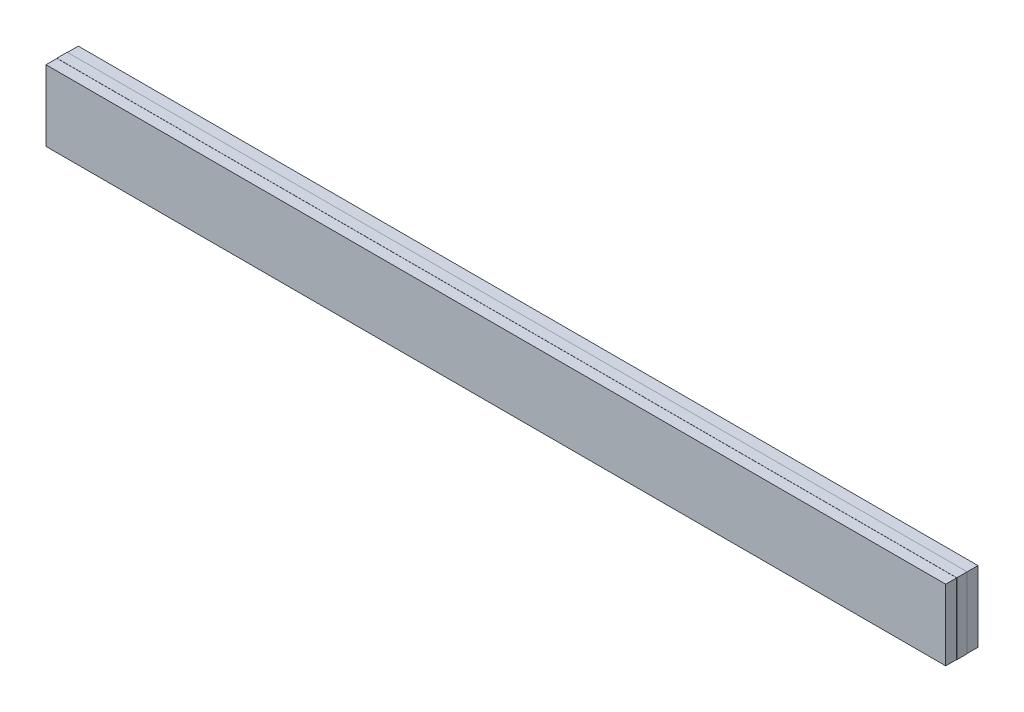
ISO-10303-21;
HEADER;
FILE_DESCRIPTION(('STEP AP214'),'2;1');
FILE_NAME('part.step','',(''),(''),'','','');
FILE_SCHEMA(('AUTOMOTIVE_DESIGN { 1 0 10303 214 1 1 1 1 }'));
ENDSEC;
DATA;
#1=APPLICATION_CONTEXT('core data for automotive mechanical design processes');
#2=APPLICATION_PROTOCOL_DEFINITION('international standard','automotive_design',2000,#1);
#3=PRODUCT_CONTEXT('',#1,'mechanical');
#4=PRODUCT('Part','Part','',(#3));
#5=PRODUCT_RELATED_PRODUCT_CATEGORY('part','',(#4));
#6=PRODUCT_DEFINITION_FORMATION('','',#4);
#7=PRODUCT_DEFINITION_CONTEXT('part definition',#1,'design');
#8=PRODUCT_DEFINITION('design','',#6,#7);
#9=PRODUCT_DEFINITION_SHAPE('','',#8);
#10=(LENGTH_UNIT() NAMED_UNIT(*) SI_UNIT(.MILLI.,.METRE.));
#11=(NAMED_UNIT(*) PLANE_ANGLE_UNIT() SI_UNIT($,.RADIAN.));
#12=(NAMED_UNIT(*) SI_UNIT($,.STERADIAN.) SOLID_ANGLE_UNIT());
#13=UNCERTAINTY_MEASURE_WITH_UNIT(LENGTH_MEASURE(1.E-05),#10,'distance_accuracy_value','');
#14=(GEOMETRIC_REPRESENTATION_CONTEXT(3) GLOBAL_UNCERTAINTY_ASSIGNED_CONTEXT((#13)) GLOBAL_UNIT_ASSIGNED_CONTEXT((#10,
#11,#12)) REPRESENTATION_CONTEXT('',''));
#15=CARTESIAN_POINT('',(0.,0.,0.));
#16=DIRECTION('',(0.,0.,1.));
#17=DIRECTION('',(1.,0.,0.));
#18=AXIS2_PLACEMENT_3D('',#15,#16,#17);
#19=CARTESIAN_POINT('',(0.,0.,-0.4));
#20=DIRECTION('',(0.,0.,1.));
#21=DIRECTION('',(1.,0.,0.));
#22=AXIS2_PLACEMENT_3D('',#19,#20,#21);
#23=PLANE('',#22);
#24=DIRECTION('',(0.,1.,0.));
#25=VECTOR('',#24,1.);
#26=CARTESIAN_POINT('',(34.85,2.75,-0.4));
#27=LINE('',#26,#25);
#28=CARTESIAN_POINT('',(34.85,-2.75,-0.4));
#29=VERTEX_POINT('',#28);
#30=CARTESIAN_POINT('',(34.85,2.75,-0.4));
#31=VERTEX_POINT('',#30);
#32=EDGE_CURVE('E185',#29,#31,#27,.T.);
#33=ORIENTED_EDGE('',*,*,#32,.F.);
#34=DIRECTION('',(1.,0.,0.));
#35=VECTOR('',#34,1.);
#36=CARTESIAN_POINT('',(-34.85,-2.75,-0.4));
#37=LINE('',#36,#35);
#38=CARTESIAN_POINT('',(-34.85,-2.75,-0.4));
#39=VERTEX_POINT('',#38);
#40=EDGE_CURVE('E190',#39,#29,#37,.T.);
#41=ORIENTED_EDGE('',*,*,#40,.F.);
#42=DIRECTION('',(0.,-1.,0.));
#43=VECTOR('',#42,1.);
#44=CARTESIAN_POINT('',(-34.85,2.75,-0.4));
#45=LINE('',#44,#43);
#46=CARTESIAN_POINT('',(-34.85,2.75,-0.4));
#47=VERTEX_POINT('',#46);
#48=EDGE_CURVE('E204',#47,#39,#45,.T.);
#49=ORIENTED_EDGE('',*,*,#48,.F.);
#50=DIRECTION('',(-1.,0.,0.));
#51=VECTOR('',#50,1.);
#52=CARTESIAN_POINT('',(-34.85,2.75,-0.4));
#53=LINE('',#52,#51);
#54=EDGE_CURVE('E201',#31,#47,#53,.T.);
#55=ORIENTED_EDGE('',*,*,#54,.F.);
#56=EDGE_LOOP('',(#33,#41,#49,#55));
#57=FACE_BOUND('',#56,.T.);
#58=DIRECTION('',(1.,0.,0.));
#59=VECTOR('',#58,1.);
#60=CARTESIAN_POINT('',(-34.84,2.74,-0.4));
#61=LINE('',#60,#59);
#62=CARTESIAN_POINT('',(-34.84,2.74,-0.4));
#63=VERTEX_POINT('',#62);
#64=CARTESIAN_POINT('',(34.84,2.74,-0.4));
#65=VERTEX_POINT('',#64);
#66=EDGE_CURVE('E146',#63,#65,#61,.T.);
#67=ORIENTED_EDGE('',*,*,#66,.F.);
#68=DIRECTION('',(0.,1.,0.));
#69=VECTOR('',#68,1.);
#70=CARTESIAN_POINT('',(-34.84,-2.74,-0.4));
#71=LINE('',#70,#69);
#72=CARTESIAN_POINT('',(-34.84,-2.74,-0.4));
#73=VERTEX_POINT('',#72);
#74=EDGE_CURVE('E143',#73,#63,#71,.T.);
#75=ORIENTED_EDGE('',*,*,#74,.F.);
#76=DIRECTION('',(-1.,0.,0.));
#77=VECTOR('',#76,1.);
#78=CARTESIAN_POINT('',(34.84,-2.74,-0.4));
#79=LINE('',#78,#77);
#80=CARTESIAN_POINT('',(34.84,-2.74,-0.4));
#81=VERTEX_POINT('',#80);
#82=EDGE_CURVE('E56',#81,#73,#79,.T.);
#83=ORIENTED_EDGE('',*,*,#82,.F.);
#84=DIRECTION('',(0.,-1.,0.));
#85=VECTOR('',#84,1.);
#86=CARTESIAN_POINT('',(34.84,2.74,-0.4));
#87=LINE('',#86,#85);
#88=EDGE_CURVE('E51',#65,#81,#87,.T.);
#89=ORIENTED_EDGE('',*,*,#88,.F.);
#90=EDGE_LOOP('',(#67,#75,#83,#89));
#91=FACE_BOUND('',#90,.T.);
#92=ADVANCED_FACE('F36',(#57,#91),#23,.F.);
#93=CARTESIAN_POINT('',(0.,0.,0.4));
#94=DIRECTION('',(0.,0.,1.));
#95=DIRECTION('',(1.,0.,0.));
#96=AXIS2_PLACEMENT_3D('',#93,#94,#95);
#97=PLANE('',#96);
#98=DIRECTION('',(0.,1.,0.));
#99=VECTOR('',#98,1.);
#100=CARTESIAN_POINT('',(34.85,2.75,0.4));
#101=LINE('',#100,#99);
#102=CARTESIAN_POINT('',(34.85,-2.75,0.4));
#103=VERTEX_POINT('',#102);
#104=CARTESIAN_POINT('',(34.85,2.75,0.4));
#105=VERTEX_POINT('',#104);
#106=EDGE_CURVE('E186',#103,#105,#101,.T.);
#107=ORIENTED_EDGE('',*,*,#106,.T.);
#108=DIRECTION('',(-1.,0.,0.));
#109=VECTOR('',#108,1.);
#110=CARTESIAN_POINT('',(-34.85,2.75,0.4));
#111=LINE('',#110,#109);
#112=CARTESIAN_POINT('',(-34.85,2.75,0.4));
#113=VERTEX_POINT('',#112);
#114=EDGE_CURVE('E189',#105,#113,#111,.T.);
#115=ORIENTED_EDGE('',*,*,#114,.T.);
#116=DIRECTION('',(0.,-1.,0.));
#117=VECTOR('',#116,1.);
#118=CARTESIAN_POINT('',(-34.85,2.75,0.4));
#119=LINE('',#118,#117);
#120=CARTESIAN_POINT('',(-34.85,-2.75,0.4));
#121=VERTEX_POINT('',#120);
#122=EDGE_CURVE('E193',#113,#121,#119,.T.);
#123=ORIENTED_EDGE('',*,*,#122,.T.);
#124=DIRECTION('',(1.,0.,0.));
#125=VECTOR('',#124,1.);
#126=CARTESIAN_POINT('',(-34.85,-2.75,0.4));
#127=LINE('',#126,#125);
#128=EDGE_CURVE('E195',#121,#103,#127,.T.);
#129=ORIENTED_EDGE('',*,*,#128,.T.);
#130=EDGE_LOOP('',(#107,#115,#123,#129));
#131=FACE_BOUND('',#130,.T.);
#132=DIRECTION('',(0.,1.,0.));
#133=VECTOR('',#132,1.);
#134=CARTESIAN_POINT('',(34.84,-2.74,0.4));
#135=LINE('',#134,#133);
#136=CARTESIAN_POINT('',(34.84,-2.74,0.4));
#137=VERTEX_POINT('',#136);
#138=CARTESIAN_POINT('',(34.84,2.74,0.4));
#139=VERTEX_POINT('',#138);
#140=EDGE_CURVE('E151',#137,#139,#135,.T.);
#141=ORIENTED_EDGE('',*,*,#140,.F.);
#142=DIRECTION('',(1.,0.,0.));
#143=VECTOR('',#142,1.);
#144=CARTESIAN_POINT('',(-34.84,-2.74,0.4));
#145=LINE('',#144,#143);
#146=CARTESIAN_POINT('',(-34.84,-2.74,0.4));
#147=VERTEX_POINT('',#146);
#148=EDGE_CURVE('E147',#147,#137,#145,.T.);
#149=ORIENTED_EDGE('',*,*,#148,.F.);
#150=DIRECTION('',(0.,-1.,0.));
#151=VECTOR('',#150,1.);
#152=CARTESIAN_POINT('',(-34.84,2.74,0.4));
#153=LINE('',#152,#151);
#154=CARTESIAN_POINT('',(-34.84,2.74,0.4));
#155=VERTEX_POINT('',#154);
#156=EDGE_CURVE('E162',#155,#147,#153,.T.);
#157=ORIENTED_EDGE('',*,*,#156,.F.);
#158=DIRECTION('',(-1.,0.,0.));
#159=VECTOR('',#158,1.);
#160=CARTESIAN_POINT('',(34.84,2.74,0.4));
#161=LINE('',#160,#159);
#162=EDGE_CURVE('E171',#139,#155,#161,.T.);
#163=ORIENTED_EDGE('',*,*,#162,.F.);
#164=EDGE_LOOP('',(#141,#149,#157,#163));
#165=FACE_BOUND('',#164,.T.);
#166=ADVANCED_FACE('F231',(#131,#165),#97,.T.);
#167=CARTESIAN_POINT('',(34.85,2.75,0.4));
#168=DIRECTION('',(-1.,0.,0.));
#169=DIRECTION('',(0.,0.,1.));
#170=AXIS2_PLACEMENT_3D('',#167,#168,#169);
#171=PLANE('',#170);
#172=ORIENTED_EDGE('',*,*,#32,.T.);
#173=DIRECTION('',(0.,0.,-1.));
#174=VECTOR('',#173,1.);
#175=CARTESIAN_POINT('',(34.85,2.75,0.4));
#176=LINE('',#175,#174);
#177=EDGE_CURVE('E11',#105,#31,#176,.T.);
#178=ORIENTED_EDGE('',*,*,#177,.F.);
#179=ORIENTED_EDGE('',*,*,#106,.F.);
#180=DIRECTION('',(0.,0.,-1.));
#181=VECTOR('',#180,1.);
#182=CARTESIAN_POINT('',(34.85,-2.75,0.4));
#183=LINE('',#182,#181);
#184=EDGE_CURVE('E198',#103,#29,#183,.T.);
#185=ORIENTED_EDGE('',*,*,#184,.T.);
#186=EDGE_LOOP('',(#172,#178,#179,#185));
#187=FACE_BOUND('',#186,.T.);
#188=ADVANCED_FACE('F38',(#187),#171,.F.);
#189=CARTESIAN_POINT('',(-34.85,2.75,0.4));
#190=DIRECTION('',(0.,-1.,0.));
#191=DIRECTION('',(0.,0.,-1.));
#192=AXIS2_PLACEMENT_3D('',#189,#190,#191);
#193=PLANE('',#192);
#194=ORIENTED_EDGE('',*,*,#54,.T.);
#195=DIRECTION('',(0.,0.,-1.));
#196=VECTOR('',#195,1.);
#197=CARTESIAN_POINT('',(-34.85,2.75,0.4));
#198=LINE('',#197,#196);
#199=EDGE_CURVE('E44',#113,#47,#198,.T.);
#200=ORIENTED_EDGE('',*,*,#199,.F.);
#201=ORIENTED_EDGE('',*,*,#114,.F.);
#202=ORIENTED_EDGE('',*,*,#177,.T.);
#203=EDGE_LOOP('',(#194,#200,#201,#202));
#204=FACE_BOUND('',#203,.T.);
#205=ADVANCED_FACE('F233',(#204),#193,.F.);
#206=CARTESIAN_POINT('',(-34.85,2.75,0.4));
#207=DIRECTION('',(1.,0.,0.));
#208=DIRECTION('',(0.,0.,-1.));
#209=AXIS2_PLACEMENT_3D('',#206,#207,#208);
#210=PLANE('',#209);
#211=ORIENTED_EDGE('',*,*,#48,.T.);
#212=DIRECTION('',(0.,0.,-1.));
#213=VECTOR('',#212,1.);
#214=CARTESIAN_POINT('',(-34.85,-2.75,0.4));
#215=LINE('',#214,#213);
#216=EDGE_CURVE('E210',#121,#39,#215,.T.);
#217=ORIENTED_EDGE('',*,*,#216,.F.);
#218=ORIENTED_EDGE('',*,*,#122,.F.);
#219=ORIENTED_EDGE('',*,*,#199,.T.);
#220=EDGE_LOOP('',(#211,#217,#218,#219));
#221=FACE_BOUND('',#220,.T.);
#222=ADVANCED_FACE('F217',(#221),#210,.F.);
#223=CARTESIAN_POINT('',(-34.85,-2.75,0.4));
#224=DIRECTION('',(0.,1.,0.));
#225=DIRECTION('',(0.,0.,1.));
#226=AXIS2_PLACEMENT_3D('',#223,#224,#225);
#227=PLANE('',#226);
#228=ORIENTED_EDGE('',*,*,#40,.T.);
#229=ORIENTED_EDGE('',*,*,#184,.F.);
#230=ORIENTED_EDGE('',*,*,#128,.F.);
#231=ORIENTED_EDGE('',*,*,#216,.T.);
#232=EDGE_LOOP('',(#228,#229,#230,#231));
#233=FACE_BOUND('',#232,.T.);
#234=ADVANCED_FACE('F225',(#233),#227,.F.);
#235=CARTESIAN_POINT('',(-34.84,-2.74,1.25));
#236=DIRECTION('',(0.,1.,0.));
#237=DIRECTION('',(0.,0.,1.));
#238=AXIS2_PLACEMENT_3D('',#235,#236,#237);
#239=PLANE('',#238);
#240=ORIENTED_EDGE('',*,*,#148,.T.);
#241=DIRECTION('',(0.,0.,-1.));
#242=VECTOR('',#241,1.);
#243=CARTESIAN_POINT('',(34.84,-2.74,1.25));
#244=LINE('',#243,#242);
#245=CARTESIAN_POINT('',(34.84,-2.74,1.25));
#246=VERTEX_POINT('',#245);
#247=EDGE_CURVE('E183',#246,#137,#244,.T.);
#248=ORIENTED_EDGE('',*,*,#247,.F.);
#249=DIRECTION('',(1.,0.,0.));
#250=VECTOR('',#249,1.);
#251=CARTESIAN_POINT('',(-34.84,-2.74,1.25));
#252=LINE('',#251,#250);
#253=CARTESIAN_POINT('',(-34.84,-2.74,1.25));
#254=VERTEX_POINT('',#253);
#255=EDGE_CURVE('E157',#254,#246,#252,.T.);
#256=ORIENTED_EDGE('',*,*,#255,.F.);
#257=DIRECTION('',(0.,0.,-1.));
#258=VECTOR('',#257,1.);
#259=CARTESIAN_POINT('',(-34.84,-2.74,1.25));
#260=LINE('',#259,#258);
#261=EDGE_CURVE('E168',#254,#147,#260,.T.);
#262=ORIENTED_EDGE('',*,*,#261,.T.);
#263=EDGE_LOOP('',(#240,#248,#256,#262));
#264=FACE_BOUND('',#263,.T.);
#265=ADVANCED_FACE('F249',(#264),#239,.F.);
#266=CARTESIAN_POINT('',(34.84,-2.74,1.25));
#267=DIRECTION('',(-1.,0.,0.));
#268=DIRECTION('',(0.,0.,1.));
#269=AXIS2_PLACEMENT_3D('',#266,#267,#268);
#270=PLANE('',#269);
#271=ORIENTED_EDGE('',*,*,#140,.T.);
#272=DIRECTION('',(0.,0.,-1.));
#273=VECTOR('',#272,1.);
#274=CARTESIAN_POINT('',(34.84,2.74,1.25));
#275=LINE('',#274,#273);
#276=CARTESIAN_POINT('',(34.84,2.74,1.25));
#277=VERTEX_POINT('',#276);
#278=EDGE_CURVE('E180',#277,#139,#275,.T.);
#279=ORIENTED_EDGE('',*,*,#278,.F.);
#280=DIRECTION('',(0.,1.,0.));
#281=VECTOR('',#280,1.);
#282=CARTESIAN_POINT('',(34.84,-2.74,1.25));
#283=LINE('',#282,#281);
#284=EDGE_CURVE('E161',#246,#277,#283,.T.);
#285=ORIENTED_EDGE('',*,*,#284,.F.);
#286=ORIENTED_EDGE('',*,*,#247,.T.);
#287=EDGE_LOOP('',(#271,#279,#285,#286));
#288=FACE_BOUND('',#287,.T.);
#289=ADVANCED_FACE('F253',(#288),#270,.F.);
#290=CARTESIAN_POINT('',(34.84,2.74,1.25));
#291=DIRECTION('',(0.,-1.,0.));
#292=DIRECTION('',(0.,0.,-1.));
#293=AXIS2_PLACEMENT_3D('',#290,#291,#292);
#294=PLANE('',#293);
#295=ORIENTED_EDGE('',*,*,#162,.T.);
#296=DIRECTION('',(0.,0.,-1.));
#297=VECTOR('',#296,1.);
#298=CARTESIAN_POINT('',(-34.84,2.74,1.25));
#299=LINE('',#298,#297);
#300=CARTESIAN_POINT('',(-34.84,2.74,1.25));
#301=VERTEX_POINT('',#300);
#302=EDGE_CURVE('E178',#301,#155,#299,.T.);
#303=ORIENTED_EDGE('',*,*,#302,.F.);
#304=DIRECTION('',(-1.,0.,0.));
#305=VECTOR('',#304,1.);
#306=CARTESIAN_POINT('',(34.84,2.74,1.25));
#307=LINE('',#306,#305);
#308=EDGE_CURVE('E164',#277,#301,#307,.T.);
#309=ORIENTED_EDGE('',*,*,#308,.F.);
#310=ORIENTED_EDGE('',*,*,#278,.T.);
#311=EDGE_LOOP('',(#295,#303,#309,#310));
#312=FACE_BOUND('',#311,.T.);
#313=ADVANCED_FACE('F258',(#312),#294,.F.);
#314=CARTESIAN_POINT('',(-34.84,2.74,1.25));
#315=DIRECTION('',(1.,0.,0.));
#316=DIRECTION('',(0.,0.,-1.));
#317=AXIS2_PLACEMENT_3D('',#314,#315,#316);
#318=PLANE('',#317);
#319=ORIENTED_EDGE('',*,*,#156,.T.);
#320=ORIENTED_EDGE('',*,*,#261,.F.);
#321=DIRECTION('',(0.,-1.,0.));
#322=VECTOR('',#321,1.);
#323=CARTESIAN_POINT('',(-34.84,2.74,1.25));
#324=LINE('',#323,#322);
#325=EDGE_CURVE('E167',#301,#254,#324,.T.);
#326=ORIENTED_EDGE('',*,*,#325,.F.);
#327=ORIENTED_EDGE('',*,*,#302,.T.);
#328=EDGE_LOOP('',(#319,#320,#326,#327));
#329=FACE_BOUND('',#328,.T.);
#330=ADVANCED_FACE('F264',(#329),#318,.F.);
#331=CARTESIAN_POINT('',(0.,0.,1.25));
#332=DIRECTION('',(0.,0.,1.));
#333=DIRECTION('',(1.,0.,0.));
#334=AXIS2_PLACEMENT_3D('',#331,#332,#333);
#335=PLANE('',#334);
#336=ORIENTED_EDGE('',*,*,#255,.T.);
#337=ORIENTED_EDGE('',*,*,#284,.T.);
#338=ORIENTED_EDGE('',*,*,#308,.T.);
#339=ORIENTED_EDGE('',*,*,#325,.T.);
#340=EDGE_LOOP('',(#336,#337,#338,#339));
#341=FACE_BOUND('',#340,.T.);
#342=ADVANCED_FACE('F268',(#341),#335,.T.);
#343=CARTESIAN_POINT('',(-34.84,2.74,-1.25));
#344=DIRECTION('',(0.,-1.,0.));
#345=DIRECTION('',(0.,0.,-1.));
#346=AXIS2_PLACEMENT_3D('',#343,#344,#345);
#347=PLANE('',#346);
#348=ORIENTED_EDGE('',*,*,#66,.T.);
#349=DIRECTION('',(0.,0.,1.));
#350=VECTOR('',#349,1.);
#351=CARTESIAN_POINT('',(34.84,2.74,-1.25));
#352=LINE('',#351,#350);
#353=CARTESIAN_POINT('',(34.84,2.74,-1.25));
#354=VERTEX_POINT('',#353);
#355=EDGE_CURVE('E126',#354,#65,#352,.T.);
#356=ORIENTED_EDGE('',*,*,#355,.F.);
#357=DIRECTION('',(1.,0.,0.));
#358=VECTOR('',#357,1.);
#359=CARTESIAN_POINT('',(-34.84,2.74,-1.25));
#360=LINE('',#359,#358);
#361=CARTESIAN_POINT('',(-34.84,2.74,-1.25));
#362=VERTEX_POINT('',#361);
#363=EDGE_CURVE('E133',#362,#354,#360,.T.);
#364=ORIENTED_EDGE('',*,*,#363,.F.);
#365=DIRECTION('',(0.,0.,1.));
#366=VECTOR('',#365,1.);
#367=CARTESIAN_POINT('',(-34.84,2.74,-1.25));
#368=LINE('',#367,#366);
#369=EDGE_CURVE('E379',#362,#63,#368,.T.);
#370=ORIENTED_EDGE('',*,*,#369,.T.);
#371=EDGE_LOOP('',(#348,#356,#364,#370));
#372=FACE_BOUND('',#371,.T.);
#373=ADVANCED_FACE('F145',(#372),#347,.F.);
#374=CARTESIAN_POINT('',(34.84,2.74,-1.25));
#375=DIRECTION('',(-1.,0.,0.));
#376=DIRECTION('',(0.,0.,1.));
#377=AXIS2_PLACEMENT_3D('',#374,#375,#376);
#378=PLANE('',#377);
#379=ORIENTED_EDGE('',*,*,#88,.T.);
#380=DIRECTION('',(0.,0.,1.));
#381=VECTOR('',#380,1.);
#382=CARTESIAN_POINT('',(34.84,-2.74,-1.25));
#383=LINE('',#382,#381);
#384=CARTESIAN_POINT('',(34.84,-2.74,-1.25));
#385=VERTEX_POINT('',#384);
#386=EDGE_CURVE('E129',#385,#81,#383,.T.);
#387=ORIENTED_EDGE('',*,*,#386,.F.);
#388=DIRECTION('',(0.,-1.,0.));
#389=VECTOR('',#388,1.);
#390=CARTESIAN_POINT('',(34.84,2.74,-1.25));
#391=LINE('',#390,#389);
#392=EDGE_CURVE('E122',#354,#385,#391,.T.);
#393=ORIENTED_EDGE('',*,*,#392,.F.);
#394=ORIENTED_EDGE('',*,*,#355,.T.);
#395=EDGE_LOOP('',(#379,#387,#393,#394));
#396=FACE_BOUND('',#395,.T.);
#397=ADVANCED_FACE('F124',(#396),#378,.F.);
#398=CARTESIAN_POINT('',(34.84,-2.74,-1.25));
#399=DIRECTION('',(0.,1.,0.));
#400=DIRECTION('',(0.,0.,1.));
#401=AXIS2_PLACEMENT_3D('',#398,#399,#400);
#402=PLANE('',#401);
#403=ORIENTED_EDGE('',*,*,#82,.T.);
#404=DIRECTION('',(0.,0.,1.));
#405=VECTOR('',#404,1.);
#406=CARTESIAN_POINT('',(-34.84,-2.74,-1.25));
#407=LINE('',#406,#405);
#408=CARTESIAN_POINT('',(-34.84,-2.74,-1.25));
#409=VERTEX_POINT('',#408);
#410=EDGE_CURVE('E153',#409,#73,#407,.T.);
#411=ORIENTED_EDGE('',*,*,#410,.F.);
#412=DIRECTION('',(-1.,0.,0.));
#413=VECTOR('',#412,1.);
#414=CARTESIAN_POINT('',(34.84,-2.74,-1.25));
#415=LINE('',#414,#413);
#416=EDGE_CURVE('E132',#385,#409,#415,.T.);
#417=ORIENTED_EDGE('',*,*,#416,.F.);
#418=ORIENTED_EDGE('',*,*,#386,.T.);
#419=EDGE_LOOP('',(#403,#411,#417,#418));
#420=FACE_BOUND('',#419,.T.);
#421=ADVANCED_FACE('F277',(#420),#402,.F.);
#422=CARTESIAN_POINT('',(-34.84,-2.74,-1.25));
#423=DIRECTION('',(1.,0.,0.));
#424=DIRECTION('',(0.,0.,-1.));
#425=AXIS2_PLACEMENT_3D('',#422,#423,#424);
#426=PLANE('',#425);
#427=ORIENTED_EDGE('',*,*,#74,.T.);
#428=ORIENTED_EDGE('',*,*,#369,.F.);
#429=DIRECTION('',(0.,1.,0.));
#430=VECTOR('',#429,1.);
#431=CARTESIAN_POINT('',(-34.84,-2.74,-1.25));
#432=LINE('',#431,#430);
#433=EDGE_CURVE('E138',#409,#362,#432,.T.);
#434=ORIENTED_EDGE('',*,*,#433,.F.);
#435=ORIENTED_EDGE('',*,*,#410,.T.);
#436=EDGE_LOOP('',(#427,#428,#434,#435));
#437=FACE_BOUND('',#436,.T.);
#438=ADVANCED_FACE('F280',(#437),#426,.F.);
#439=CARTESIAN_POINT('',(0.,0.,-1.25));
#440=DIRECTION('',(0.,0.,-1.));
#441=DIRECTION('',(-1.,0.,0.));
#442=AXIS2_PLACEMENT_3D('',#439,#440,#441);
#443=PLANE('',#442);
#444=ORIENTED_EDGE('',*,*,#363,.T.);
#445=ORIENTED_EDGE('',*,*,#392,.T.);
#446=ORIENTED_EDGE('',*,*,#416,.T.);
#447=ORIENTED_EDGE('',*,*,#433,.T.);
#448=EDGE_LOOP('',(#444,#445,#446,#447));
#449=FACE_BOUND('',#448,.T.);
#450=ADVANCED_FACE('F136',(#449),#443,.T.);
#451=CLOSED_SHELL('',(#92,#166,#188,#205,#222,#234,#265,#289,#313,#330,#342,#373,#397,#421,#438,#450));
#452=MANIFOLD_SOLID_BREP('B2',#451);
#453=ADVANCED_BREP_SHAPE_REPRESENTATION('',(#18,#452),#14);
#454=SHAPE_DEFINITION_REPRESENTATION(#9,#453);
ENDSEC;
END-ISO-10303-21;
